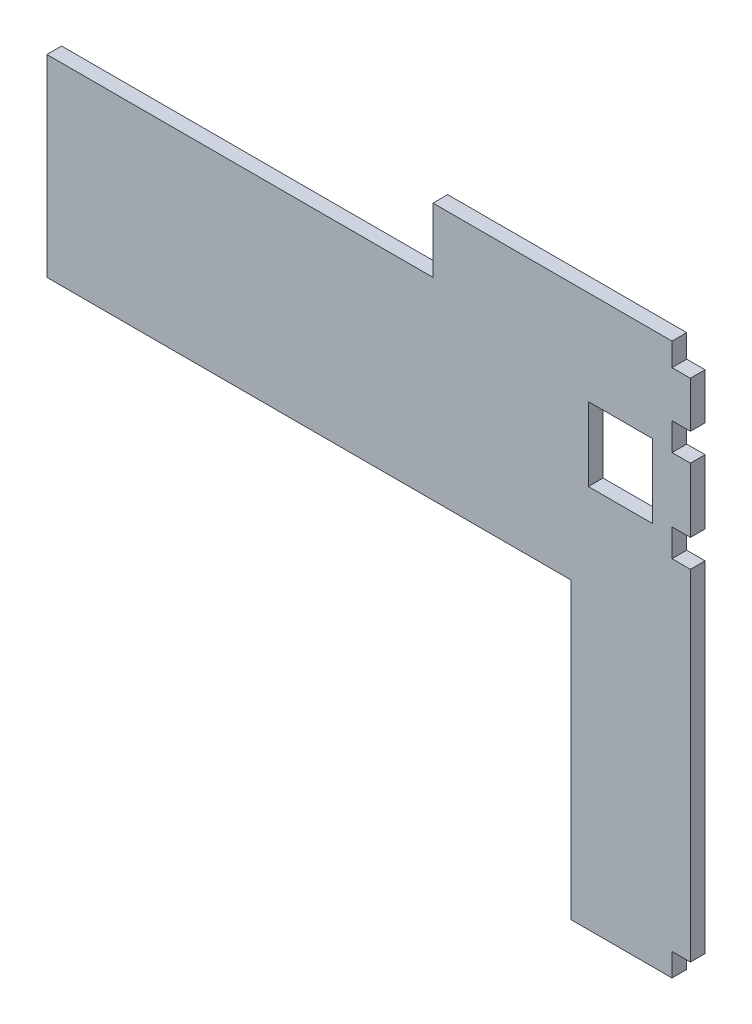
ISO-10303-21;
HEADER;
FILE_DESCRIPTION(('STEP AP214'),'2;1');
FILE_NAME('part.step','',(''),(''),'','','');
FILE_SCHEMA(('AUTOMOTIVE_DESIGN { 1 0 10303 214 1 1 1 1 }'));
ENDSEC;
DATA;
#1=APPLICATION_CONTEXT('core data for automotive mechanical design processes');
#2=APPLICATION_PROTOCOL_DEFINITION('international standard','automotive_design',2000,#1);
#3=PRODUCT_CONTEXT('',#1,'mechanical');
#4=PRODUCT('Part','Part','',(#3));
#5=PRODUCT_RELATED_PRODUCT_CATEGORY('part','',(#4));
#6=PRODUCT_DEFINITION_FORMATION('','',#4);
#7=PRODUCT_DEFINITION_CONTEXT('part definition',#1,'design');
#8=PRODUCT_DEFINITION('design','',#6,#7);
#9=PRODUCT_DEFINITION_SHAPE('','',#8);
#10=(LENGTH_UNIT() NAMED_UNIT(*) SI_UNIT(.MILLI.,.METRE.));
#11=(NAMED_UNIT(*) PLANE_ANGLE_UNIT() SI_UNIT($,.RADIAN.));
#12=(NAMED_UNIT(*) SI_UNIT($,.STERADIAN.) SOLID_ANGLE_UNIT());
#13=UNCERTAINTY_MEASURE_WITH_UNIT(LENGTH_MEASURE(1.E-05),#10,'distance_accuracy_value','');
#14=(GEOMETRIC_REPRESENTATION_CONTEXT(3) GLOBAL_UNCERTAINTY_ASSIGNED_CONTEXT((#13)) GLOBAL_UNIT_ASSIGNED_CONTEXT((#10,
#11,#12)) REPRESENTATION_CONTEXT('',''));
#15=CARTESIAN_POINT('',(0.,0.,0.));
#16=DIRECTION('',(0.,0.,1.));
#17=DIRECTION('',(1.,0.,0.));
#18=AXIS2_PLACEMENT_3D('',#15,#16,#17);
#19=CARTESIAN_POINT('',(680.,0.,16.));
#20=DIRECTION('',(-1.,0.,0.));
#21=DIRECTION('',(0.,0.,1.));
#22=AXIS2_PLACEMENT_3D('',#19,#20,#21);
#23=PLANE('',#22);
#24=DIRECTION('',(0.,1.,0.));
#25=VECTOR('',#24,1.);
#26=CARTESIAN_POINT('',(680.,0.,0.));
#27=LINE('',#26,#25);
#28=CARTESIAN_POINT('',(680.,-20.,0.));
#29=VERTEX_POINT('',#28);
#30=CARTESIAN_POINT('',(680.,4.99999999999998,0.));
#31=VERTEX_POINT('',#30);
#32=EDGE_CURVE('E37',#29,#31,#27,.T.);
#33=ORIENTED_EDGE('',*,*,#32,.T.);
#34=DIRECTION('',(0.,0.,1.));
#35=VECTOR('',#34,1.);
#36=CARTESIAN_POINT('',(680.,4.99999999999998,-370.540146272978));
#37=LINE('',#36,#35);
#38=CARTESIAN_POINT('',(680.,4.99999999999998,16.));
#39=VERTEX_POINT('',#38);
#40=EDGE_CURVE('E246',#31,#39,#37,.T.);
#41=ORIENTED_EDGE('',*,*,#40,.T.);
#42=DIRECTION('',(0.,1.,0.));
#43=VECTOR('',#42,1.);
#44=CARTESIAN_POINT('',(680.,0.,16.));
#45=LINE('',#44,#43);
#46=CARTESIAN_POINT('',(680.,-20.,16.));
#47=VERTEX_POINT('',#46);
#48=EDGE_CURVE('E11',#47,#39,#45,.T.);
#49=ORIENTED_EDGE('',*,*,#48,.F.);
#50=DIRECTION('',(0.,0.,1.));
#51=VECTOR('',#50,1.);
#52=CARTESIAN_POINT('',(680.,-20.,0.));
#53=LINE('',#52,#51);
#54=EDGE_CURVE('E364',#29,#47,#53,.T.);
#55=ORIENTED_EDGE('',*,*,#54,.F.);
#56=EDGE_LOOP('',(#33,#41,#49,#55));
#57=FACE_BOUND('',#56,.T.);
#58=ADVANCED_FACE('F33',(#57),#23,.F.);
#59=CARTESIAN_POINT('',(680.,375.,16.));
#60=VERTEX_POINT('',#59);
#61=CARTESIAN_POINT('',(680.,405.,16.));
#62=VERTEX_POINT('',#61);
#63=EDGE_CURVE('E42',#60,#62,#45,.T.);
#64=ORIENTED_EDGE('',*,*,#63,.F.);
#65=DIRECTION('',(0.,0.,1.));
#66=VECTOR('',#65,1.);
#67=CARTESIAN_POINT('',(680.,375.,-370.540146272978));
#68=LINE('',#67,#66);
#69=CARTESIAN_POINT('',(680.,375.,0.));
#70=VERTEX_POINT('',#69);
#71=EDGE_CURVE('E240',#70,#60,#68,.T.);
#72=ORIENTED_EDGE('',*,*,#71,.F.);
#73=CARTESIAN_POINT('',(680.,405.,0.));
#74=VERTEX_POINT('',#73);
#75=EDGE_CURVE('E378',#70,#74,#27,.T.);
#76=ORIENTED_EDGE('',*,*,#75,.T.);
#77=DIRECTION('',(0.,0.,1.));
#78=VECTOR('',#77,1.);
#79=CARTESIAN_POINT('',(680.,405.,-370.540146272978));
#80=LINE('',#79,#78);
#81=EDGE_CURVE('E273',#74,#62,#80,.T.);
#82=ORIENTED_EDGE('',*,*,#81,.T.);
#83=EDGE_LOOP('',(#64,#72,#76,#82));
#84=FACE_BOUND('',#83,.T.);
#85=ADVANCED_FACE('F384',(#84),#23,.F.);
#86=DIRECTION('',(0.,0.,1.));
#87=VECTOR('',#86,1.);
#88=CARTESIAN_POINT('',(680.,555.,-370.540146272978));
#89=LINE('',#88,#87);
#90=CARTESIAN_POINT('',(680.,555.,0.));
#91=VERTEX_POINT('',#90);
#92=CARTESIAN_POINT('',(680.,555.,16.));
#93=VERTEX_POINT('',#92);
#94=EDGE_CURVE('E292',#91,#93,#89,.T.);
#95=ORIENTED_EDGE('',*,*,#94,.F.);
#96=CARTESIAN_POINT('',(680.,580.,0.));
#97=VERTEX_POINT('',#96);
#98=EDGE_CURVE('E372',#91,#97,#27,.T.);
#99=ORIENTED_EDGE('',*,*,#98,.T.);
#100=DIRECTION('',(0.,0.,1.));
#101=VECTOR('',#100,1.);
#102=CARTESIAN_POINT('',(680.,580.,0.));
#103=LINE('',#102,#101);
#104=CARTESIAN_POINT('',(680.,580.,16.));
#105=VERTEX_POINT('',#104);
#106=EDGE_CURVE('E205',#97,#105,#103,.T.);
#107=ORIENTED_EDGE('',*,*,#106,.T.);
#108=EDGE_CURVE('E44',#93,#105,#45,.T.);
#109=ORIENTED_EDGE('',*,*,#108,.F.);
#110=EDGE_LOOP('',(#95,#99,#107,#109));
#111=FACE_BOUND('',#110,.T.);
#112=ADVANCED_FACE('F400',(#111),#23,.F.);
#113=CARTESIAN_POINT('',(0.,0.,16.));
#114=DIRECTION('',(1.,0.,0.));
#115=DIRECTION('',(0.,0.,-1.));
#116=AXIS2_PLACEMENT_3D('',#113,#114,#115);
#117=PLANE('',#116);
#118=DIRECTION('',(0.,-1.,0.));
#119=VECTOR('',#118,1.);
#120=CARTESIAN_POINT('',(0.,0.,0.));
#121=LINE('',#120,#119);
#122=CARTESIAN_POINT('',(0.,510.,0.));
#123=VERTEX_POINT('',#122);
#124=CARTESIAN_POINT('',(0.,300.,0.));
#125=VERTEX_POINT('',#124);
#126=EDGE_CURVE('E368',#123,#125,#121,.T.);
#127=ORIENTED_EDGE('',*,*,#126,.T.);
#128=DIRECTION('',(0.,0.,1.));
#129=VECTOR('',#128,1.);
#130=CARTESIAN_POINT('',(0.,300.,-0.001000000000001));
#131=LINE('',#130,#129);
#132=CARTESIAN_POINT('',(0.,300.,16.));
#133=VERTEX_POINT('',#132);
#134=EDGE_CURVE('E316',#125,#133,#131,.T.);
#135=ORIENTED_EDGE('',*,*,#134,.T.);
#136=DIRECTION('',(0.,-1.,0.));
#137=VECTOR('',#136,1.);
#138=CARTESIAN_POINT('',(0.,0.,16.));
#139=LINE('',#138,#137);
#140=CARTESIAN_POINT('',(0.,510.,16.));
#141=VERTEX_POINT('',#140);
#142=EDGE_CURVE('E369',#141,#133,#139,.T.);
#143=ORIENTED_EDGE('',*,*,#142,.F.);
#144=DIRECTION('',(0.,0.,1.));
#145=VECTOR('',#144,1.);
#146=CARTESIAN_POINT('',(0.,510.,-0.001000000000001));
#147=LINE('',#146,#145);
#148=EDGE_CURVE('E307',#123,#141,#147,.T.);
#149=ORIENTED_EDGE('',*,*,#148,.F.);
#150=EDGE_LOOP('',(#127,#135,#143,#149));
#151=FACE_BOUND('',#150,.T.);
#152=ADVANCED_FACE('F35',(#151),#117,.F.);
#153=CARTESIAN_POINT('',(680.,475.,16.));
#154=VERTEX_POINT('',#153);
#155=CARTESIAN_POINT('',(680.,505.,16.));
#156=VERTEX_POINT('',#155);
#157=EDGE_CURVE('E396',#154,#156,#45,.T.);
#158=ORIENTED_EDGE('',*,*,#157,.F.);
#159=DIRECTION('',(0.,0.,1.));
#160=VECTOR('',#159,1.);
#161=CARTESIAN_POINT('',(680.,475.,-370.540146272978));
#162=LINE('',#161,#160);
#163=CARTESIAN_POINT('',(680.,475.,0.));
#164=VERTEX_POINT('',#163);
#165=EDGE_CURVE('E266',#164,#154,#162,.T.);
#166=ORIENTED_EDGE('',*,*,#165,.F.);
#167=CARTESIAN_POINT('',(680.,505.,0.));
#168=VERTEX_POINT('',#167);
#169=EDGE_CURVE('E375',#164,#168,#27,.T.);
#170=ORIENTED_EDGE('',*,*,#169,.T.);
#171=DIRECTION('',(0.,0.,1.));
#172=VECTOR('',#171,1.);
#173=CARTESIAN_POINT('',(680.,505.,-370.540146272978));
#174=LINE('',#173,#172);
#175=EDGE_CURVE('E298',#168,#156,#174,.T.);
#176=ORIENTED_EDGE('',*,*,#175,.T.);
#177=EDGE_LOOP('',(#158,#166,#170,#176));
#178=FACE_BOUND('',#177,.T.);
#179=ADVANCED_FACE('F402',(#178),#23,.F.);
#180=CARTESIAN_POINT('',(0.,0.,16.));
#181=DIRECTION('',(0.,0.,-1.));
#182=DIRECTION('',(-1.,0.,0.));
#183=AXIS2_PLACEMENT_3D('',#180,#181,#182);
#184=PLANE('',#183);
#185=DIRECTION('',(-1.,0.,0.));
#186=VECTOR('',#185,1.);
#187=CARTESIAN_POINT('',(680.,580.,16.));
#188=LINE('',#187,#186);
#189=CARTESIAN_POINT('',(420.,580.,16.));
#190=VERTEX_POINT('',#189);
#191=EDGE_CURVE('E208',#105,#190,#188,.T.);
#192=ORIENTED_EDGE('',*,*,#191,.T.);
#193=DIRECTION('',(0.,-1.,0.));
#194=VECTOR('',#193,1.);
#195=CARTESIAN_POINT('',(420.,580.,16.));
#196=LINE('',#195,#194);
#197=CARTESIAN_POINT('',(420.,510.,16.));
#198=VERTEX_POINT('',#197);
#199=EDGE_CURVE('E219',#190,#198,#196,.T.);
#200=ORIENTED_EDGE('',*,*,#199,.T.);
#201=DIRECTION('',(1.,0.,0.));
#202=VECTOR('',#201,1.);
#203=CARTESIAN_POINT('',(570.,510.,16.));
#204=LINE('',#203,#202);
#205=EDGE_CURVE('E324',#141,#198,#204,.T.);
#206=ORIENTED_EDGE('',*,*,#205,.F.);
#207=ORIENTED_EDGE('',*,*,#142,.T.);
#208=DIRECTION('',(-1.,0.,0.));
#209=VECTOR('',#208,1.);
#210=CARTESIAN_POINT('',(570.,300.,16.));
#211=LINE('',#210,#209);
#212=CARTESIAN_POINT('',(570.,300.,16.));
#213=VERTEX_POINT('',#212);
#214=EDGE_CURVE('E310',#213,#133,#211,.T.);
#215=ORIENTED_EDGE('',*,*,#214,.F.);
#216=DIRECTION('',(0.,1.,0.));
#217=VECTOR('',#216,1.);
#218=CARTESIAN_POINT('',(570.,300.,16.));
#219=LINE('',#218,#217);
#220=CARTESIAN_POINT('',(570.,-20.,16.));
#221=VERTEX_POINT('',#220);
#222=EDGE_CURVE('E306',#221,#213,#219,.T.);
#223=ORIENTED_EDGE('',*,*,#222,.F.);
#224=DIRECTION('',(1.,0.,0.));
#225=VECTOR('',#224,1.);
#226=CARTESIAN_POINT('',(130.,-20.,16.));
#227=LINE('',#226,#225);
#228=EDGE_CURVE('E361',#221,#47,#227,.T.);
#229=ORIENTED_EDGE('',*,*,#228,.T.);
#230=ORIENTED_EDGE('',*,*,#48,.T.);
#231=DIRECTION('',(1.,0.,0.));
#232=VECTOR('',#231,1.);
#233=CARTESIAN_POINT('',(680.,4.99999999999998,16.));
#234=LINE('',#233,#232);
#235=CARTESIAN_POINT('',(700.,4.99999999999998,16.));
#236=VERTEX_POINT('',#235);
#237=EDGE_CURVE('E231',#39,#236,#234,.T.);
#238=ORIENTED_EDGE('',*,*,#237,.T.);
#239=DIRECTION('',(0.,1.,0.));
#240=VECTOR('',#239,1.);
#241=CARTESIAN_POINT('',(700.,4.99999999999998,16.));
#242=LINE('',#241,#240);
#243=CARTESIAN_POINT('',(700.,375.,16.));
#244=VERTEX_POINT('',#243);
#245=EDGE_CURVE('E228',#236,#244,#242,.T.);
#246=ORIENTED_EDGE('',*,*,#245,.T.);
#247=DIRECTION('',(-1.,0.,0.));
#248=VECTOR('',#247,1.);
#249=CARTESIAN_POINT('',(680.,375.,16.));
#250=LINE('',#249,#248);
#251=EDGE_CURVE('E224',#244,#60,#250,.T.);
#252=ORIENTED_EDGE('',*,*,#251,.T.);
#253=ORIENTED_EDGE('',*,*,#63,.T.);
#254=DIRECTION('',(1.,0.,0.));
#255=VECTOR('',#254,1.);
#256=CARTESIAN_POINT('',(680.,405.,16.));
#257=LINE('',#256,#255);
#258=CARTESIAN_POINT('',(700.,405.,16.));
#259=VERTEX_POINT('',#258);
#260=EDGE_CURVE('E250',#62,#259,#257,.T.);
#261=ORIENTED_EDGE('',*,*,#260,.T.);
#262=DIRECTION('',(0.,1.,0.));
#263=VECTOR('',#262,1.);
#264=CARTESIAN_POINT('',(700.,475.,16.));
#265=LINE('',#264,#263);
#266=CARTESIAN_POINT('',(700.,475.,16.));
#267=VERTEX_POINT('',#266);
#268=EDGE_CURVE('E255',#259,#267,#265,.T.);
#269=ORIENTED_EDGE('',*,*,#268,.T.);
#270=DIRECTION('',(-1.,0.,0.));
#271=VECTOR('',#270,1.);
#272=CARTESIAN_POINT('',(680.,475.,16.));
#273=LINE('',#272,#271);
#274=EDGE_CURVE('E251',#267,#154,#273,.T.);
#275=ORIENTED_EDGE('',*,*,#274,.T.);
#276=ORIENTED_EDGE('',*,*,#157,.T.);
#277=DIRECTION('',(1.,0.,0.));
#278=VECTOR('',#277,1.);
#279=CARTESIAN_POINT('',(680.,505.,16.));
#280=LINE('',#279,#278);
#281=CARTESIAN_POINT('',(700.,505.,16.));
#282=VERTEX_POINT('',#281);
#283=EDGE_CURVE('E277',#156,#282,#280,.T.);
#284=ORIENTED_EDGE('',*,*,#283,.T.);
#285=DIRECTION('',(0.,1.,0.));
#286=VECTOR('',#285,1.);
#287=CARTESIAN_POINT('',(700.,555.,16.));
#288=LINE('',#287,#286);
#289=CARTESIAN_POINT('',(700.,555.,16.));
#290=VERTEX_POINT('',#289);
#291=EDGE_CURVE('E282',#282,#290,#288,.T.);
#292=ORIENTED_EDGE('',*,*,#291,.T.);
#293=DIRECTION('',(-1.,0.,0.));
#294=VECTOR('',#293,1.);
#295=CARTESIAN_POINT('',(680.,555.,16.));
#296=LINE('',#295,#294);
#297=EDGE_CURVE('E278',#290,#93,#296,.T.);
#298=ORIENTED_EDGE('',*,*,#297,.T.);
#299=ORIENTED_EDGE('',*,*,#108,.T.);
#300=EDGE_LOOP('',(#192,#200,#206,#207,#215,#223,#229,#230,#238,#246,#252,#253,#261,#269,#275,
#276,#284,#292,#298,#299));
#301=FACE_BOUND('',#300,.T.);
#302=DIRECTION('',(-1.,0.,0.));
#303=VECTOR('',#302,1.);
#304=CARTESIAN_POINT('',(659.,477.5,16.));
#305=LINE('',#304,#303);
#306=CARTESIAN_POINT('',(659.,477.5,16.));
#307=VERTEX_POINT('',#306);
#308=CARTESIAN_POINT('',(589.,477.5,16.));
#309=VERTEX_POINT('',#308);
#310=EDGE_CURVE('E343',#307,#309,#305,.T.);
#311=ORIENTED_EDGE('',*,*,#310,.F.);
#312=DIRECTION('',(0.,1.,0.));
#313=VECTOR('',#312,1.);
#314=CARTESIAN_POINT('',(659.,397.5,16.));
#315=LINE('',#314,#313);
#316=CARTESIAN_POINT('',(659.,397.5,16.));
#317=VERTEX_POINT('',#316);
#318=EDGE_CURVE('E322',#317,#307,#315,.T.);
#319=ORIENTED_EDGE('',*,*,#318,.F.);
#320=DIRECTION('',(1.,0.,0.));
#321=VECTOR('',#320,1.);
#322=CARTESIAN_POINT('',(659.,397.5,16.));
#323=LINE('',#322,#321);
#324=CARTESIAN_POINT('',(589.,397.5,16.));
#325=VERTEX_POINT('',#324);
#326=EDGE_CURVE('E332',#325,#317,#323,.T.);
#327=ORIENTED_EDGE('',*,*,#326,.F.);
#328=DIRECTION('',(0.,-1.,0.));
#329=VECTOR('',#328,1.);
#330=CARTESIAN_POINT('',(589.,397.5,16.));
#331=LINE('',#330,#329);
#332=EDGE_CURVE('E346',#309,#325,#331,.T.);
#333=ORIENTED_EDGE('',*,*,#332,.F.);
#334=EDGE_LOOP('',(#311,#319,#327,#333));
#335=FACE_BOUND('',#334,.T.);
#336=ADVANCED_FACE('F392',(#301,#335),#184,.F.);
#337=CARTESIAN_POINT('',(0.,0.,0.));
#338=DIRECTION('',(0.,0.,-1.));
#339=DIRECTION('',(-1.,0.,0.));
#340=AXIS2_PLACEMENT_3D('',#337,#338,#339);
#341=PLANE('',#340);
#342=DIRECTION('',(0.,-1.,0.));
#343=VECTOR('',#342,1.);
#344=CARTESIAN_POINT('',(420.,580.,0.));
#345=LINE('',#344,#343);
#346=CARTESIAN_POINT('',(420.,580.,0.));
#347=VERTEX_POINT('',#346);
#348=CARTESIAN_POINT('',(420.,510.,0.));
#349=VERTEX_POINT('',#348);
#350=EDGE_CURVE('E51',#347,#349,#345,.T.);
#351=ORIENTED_EDGE('',*,*,#350,.F.);
#352=DIRECTION('',(-1.,0.,0.));
#353=VECTOR('',#352,1.);
#354=CARTESIAN_POINT('',(680.,580.,0.));
#355=LINE('',#354,#353);
#356=EDGE_CURVE('E199',#97,#347,#355,.T.);
#357=ORIENTED_EDGE('',*,*,#356,.F.);
#358=ORIENTED_EDGE('',*,*,#98,.F.);
#359=DIRECTION('',(-1.,0.,0.));
#360=VECTOR('',#359,1.);
#361=CARTESIAN_POINT('',(680.,555.,0.));
#362=LINE('',#361,#360);
#363=CARTESIAN_POINT('',(700.,555.,0.));
#364=VERTEX_POINT('',#363);
#365=EDGE_CURVE('E290',#364,#91,#362,.T.);
#366=ORIENTED_EDGE('',*,*,#365,.F.);
#367=DIRECTION('',(0.,1.,0.));
#368=VECTOR('',#367,1.);
#369=CARTESIAN_POINT('',(700.,555.,0.));
#370=LINE('',#369,#368);
#371=CARTESIAN_POINT('',(700.,505.,0.));
#372=VERTEX_POINT('',#371);
#373=EDGE_CURVE('E294',#372,#364,#370,.T.);
#374=ORIENTED_EDGE('',*,*,#373,.F.);
#375=DIRECTION('',(1.,0.,0.));
#376=VECTOR('',#375,1.);
#377=CARTESIAN_POINT('',(680.,505.,0.));
#378=LINE('',#377,#376);
#379=EDGE_CURVE('E281',#168,#372,#378,.T.);
#380=ORIENTED_EDGE('',*,*,#379,.F.);
#381=ORIENTED_EDGE('',*,*,#169,.F.);
#382=DIRECTION('',(-1.,0.,0.));
#383=VECTOR('',#382,1.);
#384=CARTESIAN_POINT('',(680.,475.,0.));
#385=LINE('',#384,#383);
#386=CARTESIAN_POINT('',(700.,475.,0.));
#387=VERTEX_POINT('',#386);
#388=EDGE_CURVE('E263',#387,#164,#385,.T.);
#389=ORIENTED_EDGE('',*,*,#388,.F.);
#390=DIRECTION('',(0.,1.,0.));
#391=VECTOR('',#390,1.);
#392=CARTESIAN_POINT('',(700.,475.,0.));
#393=LINE('',#392,#391);
#394=CARTESIAN_POINT('',(700.,405.,0.));
#395=VERTEX_POINT('',#394);
#396=EDGE_CURVE('E268',#395,#387,#393,.T.);
#397=ORIENTED_EDGE('',*,*,#396,.F.);
#398=DIRECTION('',(1.,0.,0.));
#399=VECTOR('',#398,1.);
#400=CARTESIAN_POINT('',(680.,405.,0.));
#401=LINE('',#400,#399);
#402=EDGE_CURVE('E254',#74,#395,#401,.T.);
#403=ORIENTED_EDGE('',*,*,#402,.F.);
#404=ORIENTED_EDGE('',*,*,#75,.F.);
#405=DIRECTION('',(-1.,0.,0.));
#406=VECTOR('',#405,1.);
#407=CARTESIAN_POINT('',(680.,375.,0.));
#408=LINE('',#407,#406);
#409=CARTESIAN_POINT('',(700.,375.,0.));
#410=VERTEX_POINT('',#409);
#411=EDGE_CURVE('E237',#410,#70,#408,.T.);
#412=ORIENTED_EDGE('',*,*,#411,.F.);
#413=DIRECTION('',(0.,1.,0.));
#414=VECTOR('',#413,1.);
#415=CARTESIAN_POINT('',(700.,4.99999999999998,0.));
#416=LINE('',#415,#414);
#417=CARTESIAN_POINT('',(700.,4.99999999999998,0.));
#418=VERTEX_POINT('',#417);
#419=EDGE_CURVE('E242',#418,#410,#416,.T.);
#420=ORIENTED_EDGE('',*,*,#419,.F.);
#421=DIRECTION('',(1.,0.,0.));
#422=VECTOR('',#421,1.);
#423=CARTESIAN_POINT('',(680.,4.99999999999998,0.));
#424=LINE('',#423,#422);
#425=EDGE_CURVE('E227',#31,#418,#424,.T.);
#426=ORIENTED_EDGE('',*,*,#425,.F.);
#427=ORIENTED_EDGE('',*,*,#32,.F.);
#428=DIRECTION('',(1.,0.,0.));
#429=VECTOR('',#428,1.);
#430=CARTESIAN_POINT('',(130.,-20.,0.));
#431=LINE('',#430,#429);
#432=CARTESIAN_POINT('',(570.,-20.,0.));
#433=VERTEX_POINT('',#432);
#434=EDGE_CURVE('E362',#433,#29,#431,.T.);
#435=ORIENTED_EDGE('',*,*,#434,.F.);
#436=DIRECTION('',(0.,1.,0.));
#437=VECTOR('',#436,1.);
#438=CARTESIAN_POINT('',(570.,300.,0.));
#439=LINE('',#438,#437);
#440=CARTESIAN_POINT('',(570.,300.,0.));
#441=VERTEX_POINT('',#440);
#442=EDGE_CURVE('E303',#433,#441,#439,.T.);
#443=ORIENTED_EDGE('',*,*,#442,.T.);
#444=DIRECTION('',(-1.,0.,0.));
#445=VECTOR('',#444,1.);
#446=CARTESIAN_POINT('',(570.,300.,0.));
#447=LINE('',#446,#445);
#448=EDGE_CURVE('E315',#441,#125,#447,.T.);
#449=ORIENTED_EDGE('',*,*,#448,.T.);
#450=ORIENTED_EDGE('',*,*,#126,.F.);
#451=DIRECTION('',(1.,0.,0.));
#452=VECTOR('',#451,1.);
#453=CARTESIAN_POINT('',(570.,510.,0.));
#454=LINE('',#453,#452);
#455=EDGE_CURVE('E214',#123,#349,#454,.T.);
#456=ORIENTED_EDGE('',*,*,#455,.T.);
#457=EDGE_LOOP('',(#351,#357,#358,#366,#374,#380,#381,#389,#397,#403,#404,#412,#420,#426,#427,
#435,#443,#449,#450,#456));
#458=FACE_BOUND('',#457,.T.);
#459=DIRECTION('',(0.,1.,0.));
#460=VECTOR('',#459,1.);
#461=CARTESIAN_POINT('',(659.,397.5,0.));
#462=LINE('',#461,#460);
#463=CARTESIAN_POINT('',(659.,397.5,0.));
#464=VERTEX_POINT('',#463);
#465=CARTESIAN_POINT('',(659.,477.5,0.));
#466=VERTEX_POINT('',#465);
#467=EDGE_CURVE('E328',#464,#466,#462,.T.);
#468=ORIENTED_EDGE('',*,*,#467,.T.);
#469=DIRECTION('',(-1.,0.,0.));
#470=VECTOR('',#469,1.);
#471=CARTESIAN_POINT('',(659.,477.5,0.));
#472=LINE('',#471,#470);
#473=CARTESIAN_POINT('',(589.,477.5,0.));
#474=VERTEX_POINT('',#473);
#475=EDGE_CURVE('E331',#466,#474,#472,.T.);
#476=ORIENTED_EDGE('',*,*,#475,.T.);
#477=DIRECTION('',(0.,-1.,0.));
#478=VECTOR('',#477,1.);
#479=CARTESIAN_POINT('',(589.,397.5,0.));
#480=LINE('',#479,#478);
#481=CARTESIAN_POINT('',(589.,397.5,0.));
#482=VERTEX_POINT('',#481);
#483=EDGE_CURVE('E335',#474,#482,#480,.T.);
#484=ORIENTED_EDGE('',*,*,#483,.T.);
#485=DIRECTION('',(1.,0.,0.));
#486=VECTOR('',#485,1.);
#487=CARTESIAN_POINT('',(659.,397.5,0.));
#488=LINE('',#487,#486);
#489=EDGE_CURVE('E338',#482,#464,#488,.T.);
#490=ORIENTED_EDGE('',*,*,#489,.T.);
#491=EDGE_LOOP('',(#468,#476,#484,#490));
#492=FACE_BOUND('',#491,.T.);
#493=ADVANCED_FACE('F211',(#458,#492),#341,.T.);
#494=CARTESIAN_POINT('',(130.,-20.,0.));
#495=DIRECTION('',(0.,-1.,0.));
#496=DIRECTION('',(0.,0.,-1.));
#497=AXIS2_PLACEMENT_3D('',#494,#495,#496);
#498=PLANE('',#497);
#499=DIRECTION('',(0.,0.,1.));
#500=VECTOR('',#499,1.);
#501=CARTESIAN_POINT('',(570.,-20.,-0.001000000000001));
#502=LINE('',#501,#500);
#503=EDGE_CURVE('E313',#433,#221,#502,.T.);
#504=ORIENTED_EDGE('',*,*,#503,.F.);
#505=ORIENTED_EDGE('',*,*,#434,.T.);
#506=ORIENTED_EDGE('',*,*,#54,.T.);
#507=ORIENTED_EDGE('',*,*,#228,.F.);
#508=EDGE_LOOP('',(#504,#505,#506,#507));
#509=FACE_BOUND('',#508,.T.);
#510=ADVANCED_FACE('F544',(#509),#498,.T.);
#511=CARTESIAN_POINT('',(680.,580.,0.));
#512=DIRECTION('',(0.,1.,0.));
#513=DIRECTION('',(-1.,0.,0.));
#514=AXIS2_PLACEMENT_3D('',#511,#512,#513);
#515=PLANE('',#514);
#516=ORIENTED_EDGE('',*,*,#356,.T.);
#517=DIRECTION('',(0.,0.,1.));
#518=VECTOR('',#517,1.);
#519=CARTESIAN_POINT('',(420.,580.,-165.529453572468));
#520=LINE('',#519,#518);
#521=EDGE_CURVE('E202',#347,#190,#520,.T.);
#522=ORIENTED_EDGE('',*,*,#521,.T.);
#523=ORIENTED_EDGE('',*,*,#191,.F.);
#524=ORIENTED_EDGE('',*,*,#106,.F.);
#525=EDGE_LOOP('',(#516,#522,#523,#524));
#526=FACE_BOUND('',#525,.T.);
#527=ADVANCED_FACE('F200',(#526),#515,.T.);
#528=CARTESIAN_POINT('',(659.,397.5,0.));
#529=DIRECTION('',(1.,0.,0.));
#530=DIRECTION('',(0.,0.,-1.));
#531=AXIS2_PLACEMENT_3D('',#528,#529,#530);
#532=PLANE('',#531);
#533=ORIENTED_EDGE('',*,*,#318,.T.);
#534=DIRECTION('',(0.,0.,1.));
#535=VECTOR('',#534,1.);
#536=CARTESIAN_POINT('',(659.,477.5,0.));
#537=LINE('',#536,#535);
#538=EDGE_CURVE('E341',#466,#307,#537,.T.);
#539=ORIENTED_EDGE('',*,*,#538,.F.);
#540=ORIENTED_EDGE('',*,*,#467,.F.);
#541=DIRECTION('',(0.,0.,1.));
#542=VECTOR('',#541,1.);
#543=CARTESIAN_POINT('',(659.,397.5,0.));
#544=LINE('',#543,#542);
#545=EDGE_CURVE('E351',#464,#317,#544,.T.);
#546=ORIENTED_EDGE('',*,*,#545,.T.);
#547=EDGE_LOOP('',(#533,#539,#540,#546));
#548=FACE_BOUND('',#547,.T.);
#549=ADVANCED_FACE('F553',(#548),#532,.F.);
#550=CARTESIAN_POINT('',(659.,397.5,0.));
#551=DIRECTION('',(0.,-1.,0.));
#552=DIRECTION('',(0.,0.,-1.));
#553=AXIS2_PLACEMENT_3D('',#550,#551,#552);
#554=PLANE('',#553);
#555=ORIENTED_EDGE('',*,*,#326,.T.);
#556=ORIENTED_EDGE('',*,*,#545,.F.);
#557=ORIENTED_EDGE('',*,*,#489,.F.);
#558=DIRECTION('',(0.,0.,1.));
#559=VECTOR('',#558,1.);
#560=CARTESIAN_POINT('',(589.,397.5,0.));
#561=LINE('',#560,#559);
#562=EDGE_CURVE('E353',#482,#325,#561,.T.);
#563=ORIENTED_EDGE('',*,*,#562,.T.);
#564=EDGE_LOOP('',(#555,#556,#557,#563));
#565=FACE_BOUND('',#564,.T.);
#566=ADVANCED_FACE('F587',(#565),#554,.F.);
#567=CARTESIAN_POINT('',(589.,397.5,0.));
#568=DIRECTION('',(-1.,0.,0.));
#569=DIRECTION('',(0.,-1.,0.));
#570=AXIS2_PLACEMENT_3D('',#567,#568,#569);
#571=PLANE('',#570);
#572=ORIENTED_EDGE('',*,*,#332,.T.);
#573=ORIENTED_EDGE('',*,*,#562,.F.);
#574=ORIENTED_EDGE('',*,*,#483,.F.);
#575=DIRECTION('',(0.,0.,1.));
#576=VECTOR('',#575,1.);
#577=CARTESIAN_POINT('',(589.,477.5,0.));
#578=LINE('',#577,#576);
#579=EDGE_CURVE('E355',#474,#309,#578,.T.);
#580=ORIENTED_EDGE('',*,*,#579,.T.);
#581=EDGE_LOOP('',(#572,#573,#574,#580));
#582=FACE_BOUND('',#581,.T.);
#583=ADVANCED_FACE('F590',(#582),#571,.F.);
#584=CARTESIAN_POINT('',(659.,477.5,0.));
#585=DIRECTION('',(0.,1.,0.));
#586=DIRECTION('',(0.,0.,1.));
#587=AXIS2_PLACEMENT_3D('',#584,#585,#586);
#588=PLANE('',#587);
#589=ORIENTED_EDGE('',*,*,#310,.T.);
#590=ORIENTED_EDGE('',*,*,#579,.F.);
#591=ORIENTED_EDGE('',*,*,#475,.F.);
#592=ORIENTED_EDGE('',*,*,#538,.T.);
#593=EDGE_LOOP('',(#589,#590,#591,#592));
#594=FACE_BOUND('',#593,.T.);
#595=ADVANCED_FACE('F567',(#594),#588,.F.);
#596=CARTESIAN_POINT('',(570.,510.,-0.001000000000001));
#597=DIRECTION('',(0.,-1.,0.));
#598=DIRECTION('',(0.,0.,-1.));
#599=AXIS2_PLACEMENT_3D('',#596,#597,#598);
#600=PLANE('',#599);
#601=ORIENTED_EDGE('',*,*,#205,.T.);
#602=DIRECTION('',(0.,0.,1.));
#603=VECTOR('',#602,1.);
#604=CARTESIAN_POINT('',(420.,510.,-165.529453572468));
#605=LINE('',#604,#603);
#606=EDGE_CURVE('E215',#349,#198,#605,.T.);
#607=ORIENTED_EDGE('',*,*,#606,.F.);
#608=ORIENTED_EDGE('',*,*,#455,.F.);
#609=ORIENTED_EDGE('',*,*,#148,.T.);
#610=EDGE_LOOP('',(#601,#607,#608,#609));
#611=FACE_BOUND('',#610,.T.);
#612=ADVANCED_FACE('F561',(#611),#600,.F.);
#613=CARTESIAN_POINT('',(570.,300.,-0.001000000000001));
#614=DIRECTION('',(1.,0.,0.));
#615=DIRECTION('',(0.,1.,0.));
#616=AXIS2_PLACEMENT_3D('',#613,#614,#615);
#617=PLANE('',#616);
#618=ORIENTED_EDGE('',*,*,#503,.T.);
#619=ORIENTED_EDGE('',*,*,#222,.T.);
#620=DIRECTION('',(0.,0.,1.));
#621=VECTOR('',#620,1.);
#622=CARTESIAN_POINT('',(570.,300.,-0.001000000000001));
#623=LINE('',#622,#621);
#624=EDGE_CURVE('E312',#441,#213,#623,.T.);
#625=ORIENTED_EDGE('',*,*,#624,.F.);
#626=ORIENTED_EDGE('',*,*,#442,.F.);
#627=EDGE_LOOP('',(#618,#619,#625,#626));
#628=FACE_BOUND('',#627,.T.);
#629=ADVANCED_FACE('F566',(#628),#617,.F.);
#630=CARTESIAN_POINT('',(570.,300.,-0.001000000000001));
#631=DIRECTION('',(0.,1.,0.));
#632=DIRECTION('',(-1.,0.,0.));
#633=AXIS2_PLACEMENT_3D('',#630,#631,#632);
#634=PLANE('',#633);
#635=ORIENTED_EDGE('',*,*,#624,.T.);
#636=ORIENTED_EDGE('',*,*,#214,.T.);
#637=ORIENTED_EDGE('',*,*,#134,.F.);
#638=ORIENTED_EDGE('',*,*,#448,.F.);
#639=EDGE_LOOP('',(#635,#636,#637,#638));
#640=FACE_BOUND('',#639,.T.);
#641=ADVANCED_FACE('F446',(#640),#634,.F.);
#642=CARTESIAN_POINT('',(680.,505.,-370.540146272978));
#643=DIRECTION('',(0.,-1.,0.));
#644=DIRECTION('',(0.,0.,-1.));
#645=AXIS2_PLACEMENT_3D('',#642,#643,#644);
#646=PLANE('',#645);
#647=ORIENTED_EDGE('',*,*,#175,.F.);
#648=ORIENTED_EDGE('',*,*,#379,.T.);
#649=DIRECTION('',(0.,0.,1.));
#650=VECTOR('',#649,1.);
#651=CARTESIAN_POINT('',(700.,505.,-370.540146272978));
#652=LINE('',#651,#650);
#653=EDGE_CURVE('E289',#372,#282,#652,.T.);
#654=ORIENTED_EDGE('',*,*,#653,.T.);
#655=ORIENTED_EDGE('',*,*,#283,.F.);
#656=EDGE_LOOP('',(#647,#648,#654,#655));
#657=FACE_BOUND('',#656,.T.);
#658=ADVANCED_FACE('F440',(#657),#646,.T.);
#659=CARTESIAN_POINT('',(700.,555.,-370.540146272978));
#660=DIRECTION('',(1.,0.,0.));
#661=DIRECTION('',(0.,0.,-1.));
#662=AXIS2_PLACEMENT_3D('',#659,#660,#661);
#663=PLANE('',#662);
#664=ORIENTED_EDGE('',*,*,#653,.F.);
#665=ORIENTED_EDGE('',*,*,#373,.T.);
#666=DIRECTION('',(0.,0.,1.));
#667=VECTOR('',#666,1.);
#668=CARTESIAN_POINT('',(700.,555.,-370.540146272978));
#669=LINE('',#668,#667);
#670=EDGE_CURVE('E293',#364,#290,#669,.T.);
#671=ORIENTED_EDGE('',*,*,#670,.T.);
#672=ORIENTED_EDGE('',*,*,#291,.F.);
#673=EDGE_LOOP('',(#664,#665,#671,#672));
#674=FACE_BOUND('',#673,.T.);
#675=ADVANCED_FACE('F445',(#674),#663,.T.);
#676=CARTESIAN_POINT('',(680.,555.,-370.540146272978));
#677=DIRECTION('',(0.,1.,0.));
#678=DIRECTION('',(-1.,0.,0.));
#679=AXIS2_PLACEMENT_3D('',#676,#677,#678);
#680=PLANE('',#679);
#681=ORIENTED_EDGE('',*,*,#670,.F.);
#682=ORIENTED_EDGE('',*,*,#365,.T.);
#683=ORIENTED_EDGE('',*,*,#94,.T.);
#684=ORIENTED_EDGE('',*,*,#297,.F.);
#685=EDGE_LOOP('',(#681,#682,#683,#684));
#686=FACE_BOUND('',#685,.T.);
#687=ADVANCED_FACE('F458',(#686),#680,.T.);
#688=CARTESIAN_POINT('',(680.,405.,-370.540146272978));
#689=DIRECTION('',(0.,-1.,0.));
#690=DIRECTION('',(1.,0.,0.));
#691=AXIS2_PLACEMENT_3D('',#688,#689,#690);
#692=PLANE('',#691);
#693=ORIENTED_EDGE('',*,*,#81,.F.);
#694=ORIENTED_EDGE('',*,*,#402,.T.);
#695=DIRECTION('',(0.,0.,1.));
#696=VECTOR('',#695,1.);
#697=CARTESIAN_POINT('',(700.,405.,-370.540146272978));
#698=LINE('',#697,#696);
#699=EDGE_CURVE('E262',#395,#259,#698,.T.);
#700=ORIENTED_EDGE('',*,*,#699,.T.);
#701=ORIENTED_EDGE('',*,*,#260,.F.);
#702=EDGE_LOOP('',(#693,#694,#700,#701));
#703=FACE_BOUND('',#702,.T.);
#704=ADVANCED_FACE('F389',(#703),#692,.T.);
#705=CARTESIAN_POINT('',(700.,475.,-370.540146272978));
#706=DIRECTION('',(1.,0.,0.));
#707=DIRECTION('',(0.,0.,-1.));
#708=AXIS2_PLACEMENT_3D('',#705,#706,#707);
#709=PLANE('',#708);
#710=ORIENTED_EDGE('',*,*,#699,.F.);
#711=ORIENTED_EDGE('',*,*,#396,.T.);
#712=DIRECTION('',(0.,0.,1.));
#713=VECTOR('',#712,1.);
#714=CARTESIAN_POINT('',(700.,475.,-370.540146272978));
#715=LINE('',#714,#713);
#716=EDGE_CURVE('E267',#387,#267,#715,.T.);
#717=ORIENTED_EDGE('',*,*,#716,.T.);
#718=ORIENTED_EDGE('',*,*,#268,.F.);
#719=EDGE_LOOP('',(#710,#711,#717,#718));
#720=FACE_BOUND('',#719,.T.);
#721=ADVANCED_FACE('F477',(#720),#709,.T.);
#722=CARTESIAN_POINT('',(680.,475.,-370.540146272978));
#723=DIRECTION('',(0.,1.,0.));
#724=DIRECTION('',(0.,0.,1.));
#725=AXIS2_PLACEMENT_3D('',#722,#723,#724);
#726=PLANE('',#725);
#727=ORIENTED_EDGE('',*,*,#716,.F.);
#728=ORIENTED_EDGE('',*,*,#388,.T.);
#729=ORIENTED_EDGE('',*,*,#165,.T.);
#730=ORIENTED_EDGE('',*,*,#274,.F.);
#731=EDGE_LOOP('',(#727,#728,#729,#730));
#732=FACE_BOUND('',#731,.T.);
#733=ADVANCED_FACE('F486',(#732),#726,.T.);
#734=CARTESIAN_POINT('',(680.,4.99999999999998,-370.540146272978));
#735=DIRECTION('',(0.,-1.,0.));
#736=DIRECTION('',(0.,0.,-1.));
#737=AXIS2_PLACEMENT_3D('',#734,#735,#736);
#738=PLANE('',#737);
#739=ORIENTED_EDGE('',*,*,#40,.F.);
#740=ORIENTED_EDGE('',*,*,#425,.T.);
#741=DIRECTION('',(0.,0.,1.));
#742=VECTOR('',#741,1.);
#743=CARTESIAN_POINT('',(700.,4.99999999999998,-370.540146272978));
#744=LINE('',#743,#742);
#745=EDGE_CURVE('E236',#418,#236,#744,.T.);
#746=ORIENTED_EDGE('',*,*,#745,.T.);
#747=ORIENTED_EDGE('',*,*,#237,.F.);
#748=EDGE_LOOP('',(#739,#740,#746,#747));
#749=FACE_BOUND('',#748,.T.);
#750=ADVANCED_FACE('F496',(#749),#738,.T.);
#751=CARTESIAN_POINT('',(700.,4.99999999999998,-370.540146272978));
#752=DIRECTION('',(1.,0.,0.));
#753=DIRECTION('',(0.,0.,-1.));
#754=AXIS2_PLACEMENT_3D('',#751,#752,#753);
#755=PLANE('',#754);
#756=ORIENTED_EDGE('',*,*,#745,.F.);
#757=ORIENTED_EDGE('',*,*,#419,.T.);
#758=DIRECTION('',(0.,0.,1.));
#759=VECTOR('',#758,1.);
#760=CARTESIAN_POINT('',(700.,375.,-370.540146272978));
#761=LINE('',#760,#759);
#762=EDGE_CURVE('E241',#410,#244,#761,.T.);
#763=ORIENTED_EDGE('',*,*,#762,.T.);
#764=ORIENTED_EDGE('',*,*,#245,.F.);
#765=EDGE_LOOP('',(#756,#757,#763,#764));
#766=FACE_BOUND('',#765,.T.);
#767=ADVANCED_FACE('F506',(#766),#755,.T.);
#768=CARTESIAN_POINT('',(680.,375.,-370.540146272978));
#769=DIRECTION('',(0.,1.,0.));
#770=DIRECTION('',(0.,0.,1.));
#771=AXIS2_PLACEMENT_3D('',#768,#769,#770);
#772=PLANE('',#771);
#773=ORIENTED_EDGE('',*,*,#762,.F.);
#774=ORIENTED_EDGE('',*,*,#411,.T.);
#775=ORIENTED_EDGE('',*,*,#71,.T.);
#776=ORIENTED_EDGE('',*,*,#251,.F.);
#777=EDGE_LOOP('',(#773,#774,#775,#776));
#778=FACE_BOUND('',#777,.T.);
#779=ADVANCED_FACE('F516',(#778),#772,.T.);
#780=CARTESIAN_POINT('',(420.,580.,-165.529453572468));
#781=DIRECTION('',(-1.,0.,0.));
#782=DIRECTION('',(0.,0.,1.));
#783=AXIS2_PLACEMENT_3D('',#780,#781,#782);
#784=PLANE('',#783);
#785=ORIENTED_EDGE('',*,*,#521,.F.);
#786=ORIENTED_EDGE('',*,*,#350,.T.);
#787=ORIENTED_EDGE('',*,*,#606,.T.);
#788=ORIENTED_EDGE('',*,*,#199,.F.);
#789=EDGE_LOOP('',(#785,#786,#787,#788));
#790=FACE_BOUND('',#789,.T.);
#791=ADVANCED_FACE('F217',(#790),#784,.T.);
#792=CLOSED_SHELL('',(#58,#85,#112,#152,#179,#336,#493,#510,#527,#549,#566,#583,#595,#612,#629,
#641,#658,#675,#687,#704,#721,#733,#750,#767,#779,#791));
#793=MANIFOLD_SOLID_BREP('B2',#792);
#794=ADVANCED_BREP_SHAPE_REPRESENTATION('',(#18,#793),#14);
#795=SHAPE_DEFINITION_REPRESENTATION(#9,#794);
ENDSEC;
END-ISO-10303-21;
